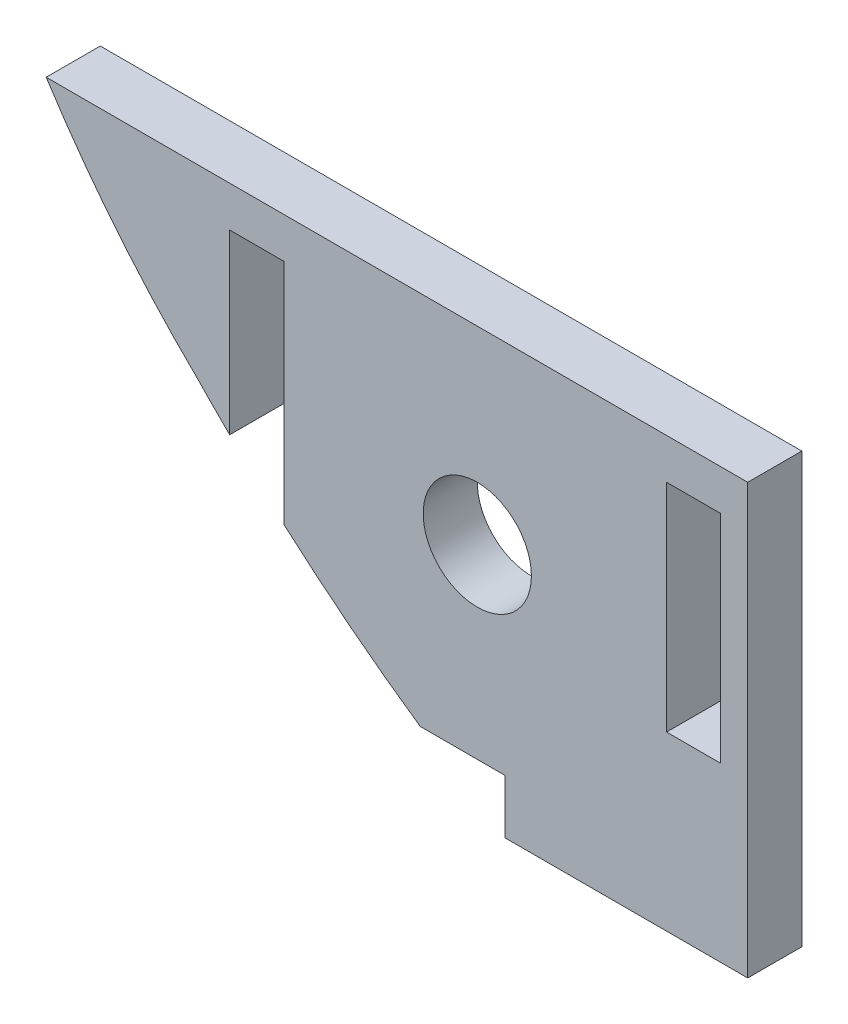
ISO-10303-21;
HEADER;
FILE_DESCRIPTION(('STEP AP214'),'2;1');
FILE_NAME('part.step','',(''),(''),'','','');
FILE_SCHEMA(('AUTOMOTIVE_DESIGN { 1 0 10303 214 1 1 1 1 }'));
ENDSEC;
DATA;
#1=APPLICATION_CONTEXT('core data for automotive mechanical design processes');
#2=APPLICATION_PROTOCOL_DEFINITION('international standard','automotive_design',2000,#1);
#3=PRODUCT_CONTEXT('',#1,'mechanical');
#4=PRODUCT('Part','Part','',(#3));
#5=PRODUCT_RELATED_PRODUCT_CATEGORY('part','',(#4));
#6=PRODUCT_DEFINITION_FORMATION('','',#4);
#7=PRODUCT_DEFINITION_CONTEXT('part definition',#1,'design');
#8=PRODUCT_DEFINITION('design','',#6,#7);
#9=PRODUCT_DEFINITION_SHAPE('','',#8);
#10=(LENGTH_UNIT() NAMED_UNIT(*) SI_UNIT(.MILLI.,.METRE.));
#11=(NAMED_UNIT(*) PLANE_ANGLE_UNIT() SI_UNIT($,.RADIAN.));
#12=(NAMED_UNIT(*) SI_UNIT($,.STERADIAN.) SOLID_ANGLE_UNIT());
#13=UNCERTAINTY_MEASURE_WITH_UNIT(LENGTH_MEASURE(1.E-05),#10,'distance_accuracy_value','');
#14=(GEOMETRIC_REPRESENTATION_CONTEXT(3) GLOBAL_UNCERTAINTY_ASSIGNED_CONTEXT((#13)) GLOBAL_UNIT_ASSIGNED_CONTEXT((#10,
#11,#12)) REPRESENTATION_CONTEXT('',''));
#15=CARTESIAN_POINT('',(0.,0.,0.));
#16=DIRECTION('',(0.,0.,1.));
#17=DIRECTION('',(1.,0.,0.));
#18=AXIS2_PLACEMENT_3D('',#15,#16,#17);
#19=CARTESIAN_POINT('',(8.86495465715672,23.9719209613924,2.));
#20=DIRECTION('',(0.,0.,1.));
#21=DIRECTION('',(1.,0.,0.));
#22=AXIS2_PLACEMENT_3D('',#19,#20,#21);
#23=PLANE('',#22);
#24=DIRECTION('',(0.,-1.,0.));
#25=VECTOR('',#24,1.);
#26=CARTESIAN_POINT('',(-0.675492065806116,-6.33042368116616,2.));
#27=LINE('',#26,#25);
#28=CARTESIAN_POINT('',(-0.675492065806116,1.66957631883384,2.));
#29=VERTEX_POINT('',#28);
#30=CARTESIAN_POINT('',(-0.675492065806116,-6.33042368116616,2.));
#31=VERTEX_POINT('',#30);
#32=EDGE_CURVE('E148',#29,#31,#27,.T.);
#33=ORIENTED_EDGE('',*,*,#32,.F.);
#34=DIRECTION('',(-1.,0.,0.));
#35=VECTOR('',#34,1.);
#36=CARTESIAN_POINT('',(-0.675492065806116,1.66957631883384,2.));
#37=LINE('',#36,#35);
#38=CARTESIAN_POINT('',(1.32450793419388,1.66957631883384,2.));
#39=VERTEX_POINT('',#38);
#40=EDGE_CURVE('E140',#39,#29,#37,.T.);
#41=ORIENTED_EDGE('',*,*,#40,.F.);
#42=DIRECTION('',(0.,1.,0.));
#43=VECTOR('',#42,1.);
#44=CARTESIAN_POINT('',(1.32450793419388,1.66957631883384,2.));
#45=LINE('',#44,#43);
#46=CARTESIAN_POINT('',(1.32450793419388,-6.33042368116616,2.));
#47=VERTEX_POINT('',#46);
#48=EDGE_CURVE('E163',#47,#39,#45,.T.);
#49=ORIENTED_EDGE('',*,*,#48,.F.);
#50=DIRECTION('',(1.,0.,0.));
#51=VECTOR('',#50,1.);
#52=CARTESIAN_POINT('',(1.32450793419388,-6.33042368116616,2.));
#53=LINE('',#52,#51);
#54=EDGE_CURVE('E161',#31,#47,#53,.T.);
#55=ORIENTED_EDGE('',*,*,#54,.F.);
#56=EDGE_LOOP('',(#33,#41,#49,#55));
#57=FACE_BOUND('',#56,.T.);
#58=DIRECTION('',(1.,0.,0.));
#59=VECTOR('',#58,1.);
#60=CARTESIAN_POINT('',(-6.6541329981665,-12.706050279369,2.));
#61=LINE('',#60,#59);
#62=CARTESIAN_POINT('',(-6.6541329981665,-12.706050279369,2.));
#63=VERTEX_POINT('',#62);
#64=CARTESIAN_POINT('',(2.32450793419389,-12.706050279369,2.));
#65=VERTEX_POINT('',#64);
#66=EDGE_CURVE('E179',#63,#65,#61,.T.);
#67=ORIENTED_EDGE('',*,*,#66,.T.);
#68=DIRECTION('',(0.,1.,0.));
#69=VECTOR('',#68,1.);
#70=CARTESIAN_POINT('',(2.32450793419389,3.16957631883384,2.));
#71=LINE('',#70,#69);
#72=CARTESIAN_POINT('',(2.32450793419389,3.16957631883384,2.));
#73=VERTEX_POINT('',#72);
#74=EDGE_CURVE('E182',#65,#73,#71,.T.);
#75=ORIENTED_EDGE('',*,*,#74,.T.);
#76=DIRECTION('',(-1.,0.,0.));
#77=VECTOR('',#76,1.);
#78=CARTESIAN_POINT('',(-23.6167131458751,3.16957631883382,2.));
#79=LINE('',#78,#77);
#80=CARTESIAN_POINT('',(-23.6167131458751,3.16957631883383,2.));
#81=VERTEX_POINT('',#80);
#82=EDGE_CURVE('E185',#73,#81,#79,.T.);
#83=ORIENTED_EDGE('',*,*,#82,.T.);
#84=CARTESIAN_POINT('',(8.86495465715672,23.9719209613924,2.));
#85=DIRECTION('',(0.,0.,1.));
#86=DIRECTION('',(1.,0.,0.));
#87=AXIS2_PLACEMENT_3D('',#84,#85,#86);
#88=CIRCLE('',#87,38.5719624325014);
#89=CARTESIAN_POINT('',(-17.9999999999967,-3.70605759852755,2.));
#90=VERTEX_POINT('',#89);
#91=EDGE_CURVE('E187',#81,#90,#88,.T.);
#92=ORIENTED_EDGE('',*,*,#91,.T.);
#93=CARTESIAN_POINT('',(20.320969023438,32.9517871888632,2.));
#94=DIRECTION('',(0.,0.,1.));
#95=DIRECTION('',(1.,0.,0.));
#96=AXIS2_PLACEMENT_3D('',#93,#94,#95);
#97=CIRCLE('',#96,53.0310687366517);
#98=CARTESIAN_POINT('',(-16.8318025278331,-4.88953701379299,2.));
#99=VERTEX_POINT('',#98);
#100=EDGE_CURVE('E189',#90,#99,#97,.T.);
#101=ORIENTED_EDGE('',*,*,#100,.T.);
#102=DIRECTION('',(0.,1.,0.));
#103=VECTOR('',#102,1.);
#104=CARTESIAN_POINT('',(-16.8318025278331,-4.88953701379299,2.));
#105=LINE('',#104,#103);
#106=CARTESIAN_POINT('',(-16.8318025278331,1.66957631883384,2.));
#107=VERTEX_POINT('',#106);
#108=EDGE_CURVE('E191',#99,#107,#105,.T.);
#109=ORIENTED_EDGE('',*,*,#108,.T.);
#110=DIRECTION('',(1.,0.,0.));
#111=VECTOR('',#110,1.);
#112=CARTESIAN_POINT('',(-16.8318025278331,1.66957631883384,2.));
#113=LINE('',#112,#111);
#114=CARTESIAN_POINT('',(-14.8318025278331,1.66957631883384,2.));
#115=VERTEX_POINT('',#114);
#116=EDGE_CURVE('E193',#107,#115,#113,.T.);
#117=ORIENTED_EDGE('',*,*,#116,.T.);
#118=DIRECTION('',(0.,-1.,0.));
#119=VECTOR('',#118,1.);
#120=CARTESIAN_POINT('',(-14.8318025278331,1.66957631883384,2.));
#121=LINE('',#120,#119);
#122=CARTESIAN_POINT('',(-14.8318025278331,-6.75434462494633,2.));
#123=VERTEX_POINT('',#122);
#124=EDGE_CURVE('E195',#115,#123,#121,.T.);
#125=ORIENTED_EDGE('',*,*,#124,.T.);
#126=CARTESIAN_POINT('',(20.320969023438,32.9517871888632,2.));
#127=DIRECTION('',(0.,0.,1.));
#128=DIRECTION('',(1.,0.,0.));
#129=AXIS2_PLACEMENT_3D('',#126,#127,#128);
#130=CIRCLE('',#129,53.0310687366517);
#131=CARTESIAN_POINT('',(-9.78363990856607,-10.706050279369,2.));
#132=VERTEX_POINT('',#131);
#133=EDGE_CURVE('E197',#123,#132,#130,.T.);
#134=ORIENTED_EDGE('',*,*,#133,.T.);
#135=DIRECTION('',(1.,0.,0.));
#136=VECTOR('',#135,1.);
#137=CARTESIAN_POINT('',(-9.78363990856607,-10.706050279369,2.));
#138=LINE('',#137,#136);
#139=CARTESIAN_POINT('',(-6.65413299816649,-10.706050279369,2.));
#140=VERTEX_POINT('',#139);
#141=EDGE_CURVE('E199',#132,#140,#138,.T.);
#142=ORIENTED_EDGE('',*,*,#141,.T.);
#143=DIRECTION('',(0.,-1.,0.));
#144=VECTOR('',#143,1.);
#145=CARTESIAN_POINT('',(-6.6541329981665,-12.706050279369,2.));
#146=LINE('',#145,#144);
#147=EDGE_CURVE('E201',#140,#63,#146,.T.);
#148=ORIENTED_EDGE('',*,*,#147,.T.);
#149=EDGE_LOOP('',(#67,#75,#83,#92,#101,#109,#117,#125,#134,#142,#148));
#150=FACE_BOUND('',#149,.T.);
#151=CARTESIAN_POINT('',(-7.67549206580617,-3.83042368116618,2.));
#152=DIRECTION('',(0.,0.,1.));
#153=DIRECTION('',(1.,0.,0.));
#154=AXIS2_PLACEMENT_3D('',#151,#152,#153);
#155=CIRCLE('',#154,2.);
#156=CARTESIAN_POINT('',(-5.67549206580618,-3.83042368116618,2.));
#157=VERTEX_POINT('',#156);
#158=EDGE_CURVE('E169',#157,#157,#155,.T.);
#159=ORIENTED_EDGE('',*,*,#158,.F.);
#160=EDGE_LOOP('',(#159));
#161=FACE_BOUND('',#160,.T.);
#162=ADVANCED_FACE('F33',(#57,#150,#161),#23,.T.);
#163=CARTESIAN_POINT('',(8.86495465715672,23.9719209613924,0.));
#164=DIRECTION('',(0.,0.,1.));
#165=DIRECTION('',(1.,0.,0.));
#166=AXIS2_PLACEMENT_3D('',#163,#164,#165);
#167=PLANE('',#166);
#168=DIRECTION('',(-1.,0.,0.));
#169=VECTOR('',#168,1.);
#170=CARTESIAN_POINT('',(-0.675492065806116,1.66957631883384,0.));
#171=LINE('',#170,#169);
#172=CARTESIAN_POINT('',(1.32450793419388,1.66957631883384,0.));
#173=VERTEX_POINT('',#172);
#174=CARTESIAN_POINT('',(-0.675492065806116,1.66957631883384,0.));
#175=VERTEX_POINT('',#174);
#176=EDGE_CURVE('E56',#173,#175,#171,.T.);
#177=ORIENTED_EDGE('',*,*,#176,.T.);
#178=DIRECTION('',(0.,-1.,0.));
#179=VECTOR('',#178,1.);
#180=CARTESIAN_POINT('',(-0.675492065806116,-6.33042368116616,0.));
#181=LINE('',#180,#179);
#182=CARTESIAN_POINT('',(-0.675492065806116,-6.33042368116616,0.));
#183=VERTEX_POINT('',#182);
#184=EDGE_CURVE('E155',#175,#183,#181,.T.);
#185=ORIENTED_EDGE('',*,*,#184,.T.);
#186=DIRECTION('',(1.,0.,0.));
#187=VECTOR('',#186,1.);
#188=CARTESIAN_POINT('',(1.32450793419388,-6.33042368116616,0.));
#189=LINE('',#188,#187);
#190=CARTESIAN_POINT('',(1.32450793419388,-6.33042368116616,0.));
#191=VERTEX_POINT('',#190);
#192=EDGE_CURVE('E171',#183,#191,#189,.T.);
#193=ORIENTED_EDGE('',*,*,#192,.T.);
#194=DIRECTION('',(0.,1.,0.));
#195=VECTOR('',#194,1.);
#196=CARTESIAN_POINT('',(1.32450793419388,1.66957631883384,0.));
#197=LINE('',#196,#195);
#198=EDGE_CURVE('E149',#191,#173,#197,.T.);
#199=ORIENTED_EDGE('',*,*,#198,.T.);
#200=EDGE_LOOP('',(#177,#185,#193,#199));
#201=FACE_BOUND('',#200,.T.);
#202=DIRECTION('',(1.,0.,0.));
#203=VECTOR('',#202,1.);
#204=CARTESIAN_POINT('',(-6.6541329981665,-12.706050279369,0.));
#205=LINE('',#204,#203);
#206=CARTESIAN_POINT('',(-6.6541329981665,-12.706050279369,0.));
#207=VERTEX_POINT('',#206);
#208=CARTESIAN_POINT('',(2.32450793419389,-12.706050279369,0.));
#209=VERTEX_POINT('',#208);
#210=EDGE_CURVE('E156',#207,#209,#205,.T.);
#211=ORIENTED_EDGE('',*,*,#210,.F.);
#212=DIRECTION('',(0.,-1.,0.));
#213=VECTOR('',#212,1.);
#214=CARTESIAN_POINT('',(-6.6541329981665,-12.706050279369,0.));
#215=LINE('',#214,#213);
#216=CARTESIAN_POINT('',(-6.65413299816649,-10.706050279369,0.));
#217=VERTEX_POINT('',#216);
#218=EDGE_CURVE('E183',#217,#207,#215,.T.);
#219=ORIENTED_EDGE('',*,*,#218,.F.);
#220=DIRECTION('',(1.,0.,0.));
#221=VECTOR('',#220,1.);
#222=CARTESIAN_POINT('',(-9.78363990856607,-10.706050279369,0.));
#223=LINE('',#222,#221);
#224=CARTESIAN_POINT('',(-9.78363990856607,-10.706050279369,0.));
#225=VERTEX_POINT('',#224);
#226=EDGE_CURVE('E222',#225,#217,#223,.T.);
#227=ORIENTED_EDGE('',*,*,#226,.F.);
#228=CARTESIAN_POINT('',(20.320969023438,32.9517871888632,0.));
#229=DIRECTION('',(0.,0.,1.));
#230=DIRECTION('',(1.,0.,0.));
#231=AXIS2_PLACEMENT_3D('',#228,#229,#230);
#232=CIRCLE('',#231,53.0310687366517);
#233=CARTESIAN_POINT('',(-14.8318025278331,-6.75434462494633,0.));
#234=VERTEX_POINT('',#233);
#235=EDGE_CURVE('E220',#234,#225,#232,.T.);
#236=ORIENTED_EDGE('',*,*,#235,.F.);
#237=DIRECTION('',(0.,-1.,0.));
#238=VECTOR('',#237,1.);
#239=CARTESIAN_POINT('',(-14.8318025278331,1.66957631883384,0.));
#240=LINE('',#239,#238);
#241=CARTESIAN_POINT('',(-14.8318025278331,1.66957631883384,0.));
#242=VERTEX_POINT('',#241);
#243=EDGE_CURVE('E218',#242,#234,#240,.T.);
#244=ORIENTED_EDGE('',*,*,#243,.F.);
#245=DIRECTION('',(1.,0.,0.));
#246=VECTOR('',#245,1.);
#247=CARTESIAN_POINT('',(-16.8318025278331,1.66957631883384,0.));
#248=LINE('',#247,#246);
#249=CARTESIAN_POINT('',(-16.8318025278331,1.66957631883384,0.));
#250=VERTEX_POINT('',#249);
#251=EDGE_CURVE('E216',#250,#242,#248,.T.);
#252=ORIENTED_EDGE('',*,*,#251,.F.);
#253=DIRECTION('',(0.,1.,0.));
#254=VECTOR('',#253,1.);
#255=CARTESIAN_POINT('',(-16.8318025278331,-4.88953701379299,0.));
#256=LINE('',#255,#254);
#257=CARTESIAN_POINT('',(-16.8318025278331,-4.88953701379299,0.));
#258=VERTEX_POINT('',#257);
#259=EDGE_CURVE('E214',#258,#250,#256,.T.);
#260=ORIENTED_EDGE('',*,*,#259,.F.);
#261=CARTESIAN_POINT('',(20.320969023438,32.9517871888632,0.));
#262=DIRECTION('',(0.,0.,1.));
#263=DIRECTION('',(1.,0.,0.));
#264=AXIS2_PLACEMENT_3D('',#261,#262,#263);
#265=CIRCLE('',#264,53.0310687366517);
#266=CARTESIAN_POINT('',(-17.9999999999967,-3.70605759852755,0.));
#267=VERTEX_POINT('',#266);
#268=EDGE_CURVE('E212',#267,#258,#265,.T.);
#269=ORIENTED_EDGE('',*,*,#268,.F.);
#270=CARTESIAN_POINT('',(8.86495465715672,23.9719209613924,0.));
#271=DIRECTION('',(0.,0.,1.));
#272=DIRECTION('',(1.,0.,0.));
#273=AXIS2_PLACEMENT_3D('',#270,#271,#272);
#274=CIRCLE('',#273,38.5719624325014);
#275=CARTESIAN_POINT('',(-23.6167131458751,3.16957631883383,0.));
#276=VERTEX_POINT('',#275);
#277=EDGE_CURVE('E210',#276,#267,#274,.T.);
#278=ORIENTED_EDGE('',*,*,#277,.F.);
#279=DIRECTION('',(-1.,0.,0.));
#280=VECTOR('',#279,1.);
#281=CARTESIAN_POINT('',(-23.6167131458751,3.16957631883382,0.));
#282=LINE('',#281,#280);
#283=CARTESIAN_POINT('',(2.32450793419389,3.16957631883384,0.));
#284=VERTEX_POINT('',#283);
#285=EDGE_CURVE('E208',#284,#276,#282,.T.);
#286=ORIENTED_EDGE('',*,*,#285,.F.);
#287=DIRECTION('',(0.,1.,0.));
#288=VECTOR('',#287,1.);
#289=CARTESIAN_POINT('',(2.32450793419389,3.16957631883384,0.));
#290=LINE('',#289,#288);
#291=EDGE_CURVE('E206',#209,#284,#290,.T.);
#292=ORIENTED_EDGE('',*,*,#291,.F.);
#293=EDGE_LOOP('',(#211,#219,#227,#236,#244,#252,#260,#269,#278,#286,#292));
#294=FACE_BOUND('',#293,.T.);
#295=CARTESIAN_POINT('',(-7.67549206580617,-3.83042368116618,0.));
#296=DIRECTION('',(0.,0.,1.));
#297=DIRECTION('',(1.,0.,0.));
#298=AXIS2_PLACEMENT_3D('',#295,#296,#297);
#299=CIRCLE('',#298,2.);
#300=CARTESIAN_POINT('',(-5.67549206580618,-3.83042368116618,0.));
#301=VERTEX_POINT('',#300);
#302=EDGE_CURVE('E466',#301,#301,#299,.T.);
#303=ORIENTED_EDGE('',*,*,#302,.T.);
#304=EDGE_LOOP('',(#303));
#305=FACE_BOUND('',#304,.T.);
#306=ADVANCED_FACE('F261',(#201,#294,#305),#167,.F.);
#307=CARTESIAN_POINT('',(-6.6541329981665,-12.706050279369,2.));
#308=DIRECTION('',(0.,1.,0.));
#309=DIRECTION('',(-1.,0.,0.));
#310=AXIS2_PLACEMENT_3D('',#307,#308,#309);
#311=PLANE('',#310);
#312=ORIENTED_EDGE('',*,*,#210,.T.);
#313=DIRECTION('',(0.,0.,-1.));
#314=VECTOR('',#313,1.);
#315=CARTESIAN_POINT('',(2.32450793419389,-12.706050279369,2.));
#316=LINE('',#315,#314);
#317=EDGE_CURVE('E11',#65,#209,#316,.T.);
#318=ORIENTED_EDGE('',*,*,#317,.F.);
#319=ORIENTED_EDGE('',*,*,#66,.F.);
#320=DIRECTION('',(0.,0.,-1.));
#321=VECTOR('',#320,1.);
#322=CARTESIAN_POINT('',(-6.6541329981665,-12.706050279369,2.));
#323=LINE('',#322,#321);
#324=EDGE_CURVE('E203',#63,#207,#323,.T.);
#325=ORIENTED_EDGE('',*,*,#324,.T.);
#326=EDGE_LOOP('',(#312,#318,#319,#325));
#327=FACE_BOUND('',#326,.T.);
#328=ADVANCED_FACE('F35',(#327),#311,.F.);
#329=CARTESIAN_POINT('',(2.32450793419389,3.16957631883384,2.));
#330=DIRECTION('',(-1.,0.,0.));
#331=DIRECTION('',(0.,0.,1.));
#332=AXIS2_PLACEMENT_3D('',#329,#330,#331);
#333=PLANE('',#332);
#334=ORIENTED_EDGE('',*,*,#291,.T.);
#335=DIRECTION('',(0.,0.,-1.));
#336=VECTOR('',#335,1.);
#337=CARTESIAN_POINT('',(2.32450793419389,3.16957631883384,2.));
#338=LINE('',#337,#336);
#339=EDGE_CURVE('E41',#73,#284,#338,.T.);
#340=ORIENTED_EDGE('',*,*,#339,.F.);
#341=ORIENTED_EDGE('',*,*,#74,.F.);
#342=ORIENTED_EDGE('',*,*,#317,.T.);
#343=EDGE_LOOP('',(#334,#340,#341,#342));
#344=FACE_BOUND('',#343,.T.);
#345=ADVANCED_FACE('F278',(#344),#333,.F.);
#346=CARTESIAN_POINT('',(-23.6167131458751,3.16957631883382,2.));
#347=DIRECTION('',(0.,-1.,0.));
#348=DIRECTION('',(1.,0.,0.));
#349=AXIS2_PLACEMENT_3D('',#346,#347,#348);
#350=PLANE('',#349);
#351=ORIENTED_EDGE('',*,*,#285,.T.);
#352=DIRECTION('',(0.,0.,-1.));
#353=VECTOR('',#352,1.);
#354=CARTESIAN_POINT('',(-23.6167131458751,3.16957631883383,2.));
#355=LINE('',#354,#353);
#356=EDGE_CURVE('E248',#81,#276,#355,.T.);
#357=ORIENTED_EDGE('',*,*,#356,.F.);
#358=ORIENTED_EDGE('',*,*,#82,.F.);
#359=ORIENTED_EDGE('',*,*,#339,.T.);
#360=EDGE_LOOP('',(#351,#357,#358,#359));
#361=FACE_BOUND('',#360,.T.);
#362=ADVANCED_FACE('F255',(#361),#350,.F.);
#363=CARTESIAN_POINT('',(8.86495465715672,23.9719209613924,2.));
#364=DIRECTION('',(0.,0.,-1.));
#365=DIRECTION('',(-1.,0.,0.));
#366=AXIS2_PLACEMENT_3D('',#363,#364,#365);
#367=CYLINDRICAL_SURFACE('',#366,38.5719624325014);
#368=ORIENTED_EDGE('',*,*,#277,.T.);
#369=DIRECTION('',(0.,0.,-1.));
#370=VECTOR('',#369,1.);
#371=CARTESIAN_POINT('',(-17.9999999999967,-3.70605759852755,2.));
#372=LINE('',#371,#370);
#373=EDGE_CURVE('E245',#90,#267,#372,.T.);
#374=ORIENTED_EDGE('',*,*,#373,.F.);
#375=ORIENTED_EDGE('',*,*,#91,.F.);
#376=ORIENTED_EDGE('',*,*,#356,.T.);
#377=EDGE_LOOP('',(#368,#374,#375,#376));
#378=FACE_BOUND('',#377,.T.);
#379=ADVANCED_FACE('F267',(#378),#367,.T.);
#380=CARTESIAN_POINT('',(20.320969023438,32.9517871888632,2.));
#381=DIRECTION('',(0.,0.,-1.));
#382=DIRECTION('',(-1.,0.,0.));
#383=AXIS2_PLACEMENT_3D('',#380,#381,#382);
#384=CYLINDRICAL_SURFACE('',#383,53.0310687366517);
#385=ORIENTED_EDGE('',*,*,#268,.T.);
#386=DIRECTION('',(0.,0.,-1.));
#387=VECTOR('',#386,1.);
#388=CARTESIAN_POINT('',(-16.8318025278331,-4.88953701379299,2.));
#389=LINE('',#388,#387);
#390=EDGE_CURVE('E242',#99,#258,#389,.T.);
#391=ORIENTED_EDGE('',*,*,#390,.F.);
#392=ORIENTED_EDGE('',*,*,#100,.F.);
#393=ORIENTED_EDGE('',*,*,#373,.T.);
#394=EDGE_LOOP('',(#385,#391,#392,#393));
#395=FACE_BOUND('',#394,.T.);
#396=ADVANCED_FACE('F271',(#395),#384,.T.);
#397=CARTESIAN_POINT('',(-16.8318025278331,-4.88953701379299,2.));
#398=DIRECTION('',(-1.,0.,0.));
#399=DIRECTION('',(0.,0.,1.));
#400=AXIS2_PLACEMENT_3D('',#397,#398,#399);
#401=PLANE('',#400);
#402=ORIENTED_EDGE('',*,*,#259,.T.);
#403=DIRECTION('',(0.,0.,-1.));
#404=VECTOR('',#403,1.);
#405=CARTESIAN_POINT('',(-16.8318025278331,1.66957631883384,2.));
#406=LINE('',#405,#404);
#407=EDGE_CURVE('E239',#107,#250,#406,.T.);
#408=ORIENTED_EDGE('',*,*,#407,.F.);
#409=ORIENTED_EDGE('',*,*,#108,.F.);
#410=ORIENTED_EDGE('',*,*,#390,.T.);
#411=EDGE_LOOP('',(#402,#408,#409,#410));
#412=FACE_BOUND('',#411,.T.);
#413=ADVANCED_FACE('F306',(#412),#401,.F.);
#414=CARTESIAN_POINT('',(-16.8318025278331,1.66957631883384,2.));
#415=DIRECTION('',(0.,1.,0.));
#416=DIRECTION('',(0.,0.,1.));
#417=AXIS2_PLACEMENT_3D('',#414,#415,#416);
#418=PLANE('',#417);
#419=ORIENTED_EDGE('',*,*,#251,.T.);
#420=DIRECTION('',(0.,0.,-1.));
#421=VECTOR('',#420,1.);
#422=CARTESIAN_POINT('',(-14.8318025278331,1.66957631883384,2.));
#423=LINE('',#422,#421);
#424=EDGE_CURVE('E236',#115,#242,#423,.T.);
#425=ORIENTED_EDGE('',*,*,#424,.F.);
#426=ORIENTED_EDGE('',*,*,#116,.F.);
#427=ORIENTED_EDGE('',*,*,#407,.T.);
#428=EDGE_LOOP('',(#419,#425,#426,#427));
#429=FACE_BOUND('',#428,.T.);
#430=ADVANCED_FACE('F304',(#429),#418,.F.);
#431=CARTESIAN_POINT('',(-14.8318025278331,1.66957631883384,2.));
#432=DIRECTION('',(1.,0.,0.));
#433=DIRECTION('',(0.,1.,0.));
#434=AXIS2_PLACEMENT_3D('',#431,#432,#433);
#435=PLANE('',#434);
#436=ORIENTED_EDGE('',*,*,#243,.T.);
#437=DIRECTION('',(0.,0.,-1.));
#438=VECTOR('',#437,1.);
#439=CARTESIAN_POINT('',(-14.8318025278331,-6.75434462494633,2.));
#440=LINE('',#439,#438);
#441=EDGE_CURVE('E233',#123,#234,#440,.T.);
#442=ORIENTED_EDGE('',*,*,#441,.F.);
#443=ORIENTED_EDGE('',*,*,#124,.F.);
#444=ORIENTED_EDGE('',*,*,#424,.T.);
#445=EDGE_LOOP('',(#436,#442,#443,#444));
#446=FACE_BOUND('',#445,.T.);
#447=ADVANCED_FACE('F299',(#446),#435,.F.);
#448=CARTESIAN_POINT('',(20.320969023438,32.9517871888632,2.));
#449=DIRECTION('',(0.,0.,-1.));
#450=DIRECTION('',(-1.,0.,0.));
#451=AXIS2_PLACEMENT_3D('',#448,#449,#450);
#452=CYLINDRICAL_SURFACE('',#451,53.0310687366517);
#453=ORIENTED_EDGE('',*,*,#235,.T.);
#454=DIRECTION('',(0.,0.,-1.));
#455=VECTOR('',#454,1.);
#456=CARTESIAN_POINT('',(-9.78363990856607,-10.706050279369,2.));
#457=LINE('',#456,#455);
#458=EDGE_CURVE('E230',#132,#225,#457,.T.);
#459=ORIENTED_EDGE('',*,*,#458,.F.);
#460=ORIENTED_EDGE('',*,*,#133,.F.);
#461=ORIENTED_EDGE('',*,*,#441,.T.);
#462=EDGE_LOOP('',(#453,#459,#460,#461));
#463=FACE_BOUND('',#462,.T.);
#464=ADVANCED_FACE('F294',(#463),#452,.T.);
#465=CARTESIAN_POINT('',(-9.78363990856607,-10.706050279369,2.));
#466=DIRECTION('',(0.,1.,0.));
#467=DIRECTION('',(-1.,0.,0.));
#468=AXIS2_PLACEMENT_3D('',#465,#466,#467);
#469=PLANE('',#468);
#470=ORIENTED_EDGE('',*,*,#226,.T.);
#471=DIRECTION('',(0.,0.,-1.));
#472=VECTOR('',#471,1.);
#473=CARTESIAN_POINT('',(-6.65413299816649,-10.706050279369,2.));
#474=LINE('',#473,#472);
#475=EDGE_CURVE('E227',#140,#217,#474,.T.);
#476=ORIENTED_EDGE('',*,*,#475,.F.);
#477=ORIENTED_EDGE('',*,*,#141,.F.);
#478=ORIENTED_EDGE('',*,*,#458,.T.);
#479=EDGE_LOOP('',(#470,#476,#477,#478));
#480=FACE_BOUND('',#479,.T.);
#481=ADVANCED_FACE('F290',(#480),#469,.F.);
#482=CARTESIAN_POINT('',(-6.6541329981665,-12.706050279369,2.));
#483=DIRECTION('',(1.,0.,0.));
#484=DIRECTION('',(0.,1.,0.));
#485=AXIS2_PLACEMENT_3D('',#482,#483,#484);
#486=PLANE('',#485);
#487=ORIENTED_EDGE('',*,*,#218,.T.);
#488=ORIENTED_EDGE('',*,*,#324,.F.);
#489=ORIENTED_EDGE('',*,*,#147,.F.);
#490=ORIENTED_EDGE('',*,*,#475,.T.);
#491=EDGE_LOOP('',(#487,#488,#489,#490));
#492=FACE_BOUND('',#491,.T.);
#493=ADVANCED_FACE('F285',(#492),#486,.F.);
#494=CARTESIAN_POINT('',(-0.675492065806116,1.66957631883384,2.));
#495=DIRECTION('',(0.,-1.,0.));
#496=DIRECTION('',(1.,0.,0.));
#497=AXIS2_PLACEMENT_3D('',#494,#495,#496);
#498=PLANE('',#497);
#499=ORIENTED_EDGE('',*,*,#176,.F.);
#500=DIRECTION('',(0.,0.,-1.));
#501=VECTOR('',#500,1.);
#502=CARTESIAN_POINT('',(1.32450793419388,1.66957631883384,2.));
#503=LINE('',#502,#501);
#504=EDGE_CURVE('E144',#39,#173,#503,.T.);
#505=ORIENTED_EDGE('',*,*,#504,.F.);
#506=ORIENTED_EDGE('',*,*,#40,.T.);
#507=DIRECTION('',(0.,0.,-1.));
#508=VECTOR('',#507,1.);
#509=CARTESIAN_POINT('',(-0.675492065806116,1.66957631883384,2.));
#510=LINE('',#509,#508);
#511=EDGE_CURVE('E143',#29,#175,#510,.T.);
#512=ORIENTED_EDGE('',*,*,#511,.T.);
#513=EDGE_LOOP('',(#499,#505,#506,#512));
#514=FACE_BOUND('',#513,.T.);
#515=ADVANCED_FACE('F142',(#514),#498,.T.);
#516=CARTESIAN_POINT('',(-0.675492065806116,-6.33042368116616,2.));
#517=DIRECTION('',(1.,0.,0.));
#518=DIRECTION('',(0.,0.,-1.));
#519=AXIS2_PLACEMENT_3D('',#516,#517,#518);
#520=PLANE('',#519);
#521=ORIENTED_EDGE('',*,*,#184,.F.);
#522=ORIENTED_EDGE('',*,*,#511,.F.);
#523=ORIENTED_EDGE('',*,*,#32,.T.);
#524=DIRECTION('',(0.,0.,-1.));
#525=VECTOR('',#524,1.);
#526=CARTESIAN_POINT('',(-0.675492065806116,-6.33042368116616,2.));
#527=LINE('',#526,#525);
#528=EDGE_CURVE('E157',#31,#183,#527,.T.);
#529=ORIENTED_EDGE('',*,*,#528,.T.);
#530=EDGE_LOOP('',(#521,#522,#523,#529));
#531=FACE_BOUND('',#530,.T.);
#532=ADVANCED_FACE('F152',(#531),#520,.T.);
#533=CARTESIAN_POINT('',(1.32450793419388,-6.33042368116616,2.));
#534=DIRECTION('',(0.,1.,0.));
#535=DIRECTION('',(-1.,0.,0.));
#536=AXIS2_PLACEMENT_3D('',#533,#534,#535);
#537=PLANE('',#536);
#538=ORIENTED_EDGE('',*,*,#192,.F.);
#539=ORIENTED_EDGE('',*,*,#528,.F.);
#540=ORIENTED_EDGE('',*,*,#54,.T.);
#541=DIRECTION('',(0.,0.,-1.));
#542=VECTOR('',#541,1.);
#543=CARTESIAN_POINT('',(1.32450793419388,-6.33042368116616,2.));
#544=LINE('',#543,#542);
#545=EDGE_CURVE('E48',#47,#191,#544,.T.);
#546=ORIENTED_EDGE('',*,*,#545,.T.);
#547=EDGE_LOOP('',(#538,#539,#540,#546));
#548=FACE_BOUND('',#547,.T.);
#549=ADVANCED_FACE('F359',(#548),#537,.T.);
#550=CARTESIAN_POINT('',(1.32450793419388,1.66957631883384,2.));
#551=DIRECTION('',(-1.,0.,0.));
#552=DIRECTION('',(0.,-1.,0.));
#553=AXIS2_PLACEMENT_3D('',#550,#551,#552);
#554=PLANE('',#553);
#555=ORIENTED_EDGE('',*,*,#198,.F.);
#556=ORIENTED_EDGE('',*,*,#545,.F.);
#557=ORIENTED_EDGE('',*,*,#48,.T.);
#558=ORIENTED_EDGE('',*,*,#504,.T.);
#559=EDGE_LOOP('',(#555,#556,#557,#558));
#560=FACE_BOUND('',#559,.T.);
#561=ADVANCED_FACE('F365',(#560),#554,.T.);
#562=CARTESIAN_POINT('',(-7.67549206580617,-3.83042368116618,2.));
#563=DIRECTION('',(0.,0.,-1.));
#564=DIRECTION('',(-1.,0.,0.));
#565=AXIS2_PLACEMENT_3D('',#562,#563,#564);
#566=CYLINDRICAL_SURFACE('',#565,2.);
#567=ORIENTED_EDGE('',*,*,#158,.T.);
#568=EDGE_LOOP('',(#567));
#569=FACE_BOUND('',#568,.T.);
#570=ORIENTED_EDGE('',*,*,#302,.F.);
#571=EDGE_LOOP('',(#570));
#572=FACE_BOUND('',#571,.T.);
#573=ADVANCED_FACE('F373',(#569,#572),#566,.F.);
#574=CLOSED_SHELL('',(#162,#306,#328,#345,#362,#379,#396,#413,#430,#447,#464,#481,#493,#515,
#532,#549,#561,#573));
#575=MANIFOLD_SOLID_BREP('B2',#574);
#576=ADVANCED_BREP_SHAPE_REPRESENTATION('',(#18,#575),#14);
#577=SHAPE_DEFINITION_REPRESENTATION(#9,#576);
ENDSEC;
END-ISO-10303-21;
